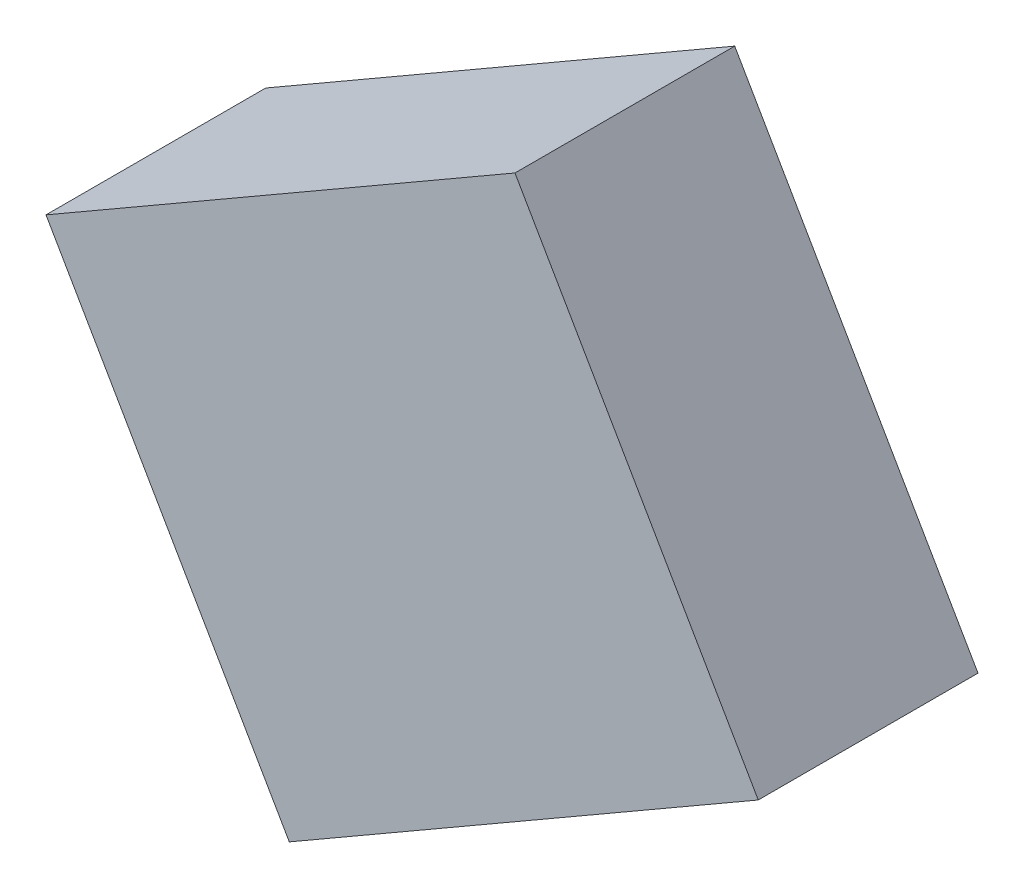
ISO-10303-21;
HEADER;
FILE_DESCRIPTION(('STEP AP214'),'2;1');
FILE_NAME('part.step','',(''),(''),'','','');
FILE_SCHEMA(('AUTOMOTIVE_DESIGN { 1 0 10303 214 1 1 1 1 }'));
ENDSEC;
DATA;
#1=APPLICATION_CONTEXT('core data for automotive mechanical design processes');
#2=APPLICATION_PROTOCOL_DEFINITION('international standard','automotive_design',2000,#1);
#3=PRODUCT_CONTEXT('',#1,'mechanical');
#4=PRODUCT('Part','Part','',(#3));
#5=PRODUCT_RELATED_PRODUCT_CATEGORY('part','',(#4));
#6=PRODUCT_DEFINITION_FORMATION('','',#4);
#7=PRODUCT_DEFINITION_CONTEXT('part definition',#1,'design');
#8=PRODUCT_DEFINITION('design','',#6,#7);
#9=PRODUCT_DEFINITION_SHAPE('','',#8);
#10=(LENGTH_UNIT() NAMED_UNIT(*) SI_UNIT(.MILLI.,.METRE.));
#11=(NAMED_UNIT(*) PLANE_ANGLE_UNIT() SI_UNIT($,.RADIAN.));
#12=(NAMED_UNIT(*) SI_UNIT($,.STERADIAN.) SOLID_ANGLE_UNIT());
#13=UNCERTAINTY_MEASURE_WITH_UNIT(LENGTH_MEASURE(1.E-05),#10,'distance_accuracy_value','');
#14=(GEOMETRIC_REPRESENTATION_CONTEXT(3) GLOBAL_UNCERTAINTY_ASSIGNED_CONTEXT((#13)) GLOBAL_UNIT_ASSIGNED_CONTEXT((#10,
#11,#12)) REPRESENTATION_CONTEXT('',''));
#15=CARTESIAN_POINT('',(0.,0.,0.));
#16=DIRECTION('',(0.,0.,1.));
#17=DIRECTION('',(1.,0.,0.));
#18=AXIS2_PLACEMENT_3D('',#15,#16,#17);
#19=CARTESIAN_POINT('',(-2.2688931,0.47984156,1.39999974));
#20=DIRECTION('',(0.,0.,-1.));
#21=DIRECTION('',(-1.,0.,0.));
#22=AXIS2_PLACEMENT_3D('',#19,#20,#21);
#23=PLANE('',#22);
#24=DIRECTION('',(-0.866024975812802,-0.500000741267886,0.));
#25=VECTOR('',#24,1.);
#26=CARTESIAN_POINT('',(-0.71889366,-2.20483938,1.39999974));
#27=LINE('',#26,#25);
#28=CARTESIAN_POINT('',(-0.718893659999777,-2.20483937999987,1.39999974));
#29=VERTEX_POINT('',#28);
#30=CARTESIAN_POINT('',(2.26889309999989,-0.479836479999813,1.39999974));
#31=VERTEX_POINT('',#30);
#32=EDGE_CURVE('E55',#29,#31,#27,.F.);
#33=ORIENTED_EDGE('',*,*,#32,.T.);
#34=DIRECTION('',(0.499999913646723,-0.866025453640521,0.));
#35=VECTOR('',#34,1.);
#36=CARTESIAN_POINT('',(2.2688931,-0.47983648,1.39999974));
#37=LINE('',#36,#35);
#38=CARTESIAN_POINT('',(0.718893659999855,2.20484191999992,1.39999974));
#39=VERTEX_POINT('',#38);
#40=EDGE_CURVE('E57',#31,#39,#37,.F.);
#41=ORIENTED_EDGE('',*,*,#40,.T.);
#42=DIRECTION('',(0.866025294610955,0.500000189093974,0.));
#43=VECTOR('',#42,1.);
#44=CARTESIAN_POINT('',(0.71889366,2.20484192,1.39999974));
#45=LINE('',#44,#43);
#46=CARTESIAN_POINT('',(-2.26889310000013,0.47984156000023,1.39999974));
#47=VERTEX_POINT('',#46);
#48=EDGE_CURVE('E20',#39,#47,#45,.F.);
#49=ORIENTED_EDGE('',*,*,#48,.T.);
#50=DIRECTION('',(-0.499999558855955,0.866025658478922,0.));
#51=VECTOR('',#50,1.);
#52=CARTESIAN_POINT('',(-2.2688931,0.47984156,1.39999974));
#53=LINE('',#52,#51);
#54=EDGE_CURVE('E80',#47,#29,#53,.F.);
#55=ORIENTED_EDGE('',*,*,#54,.T.);
#56=EDGE_LOOP('',(#33,#41,#49,#55));
#57=FACE_BOUND('',#56,.T.);
#58=ADVANCED_FACE('F17',(#57),#23,.F.);
#59=CARTESIAN_POINT('',(0.71889366,2.20484192,0.));
#60=DIRECTION('',(0.500000189093974,-0.866025294610955,0.));
#61=DIRECTION('',(0.866025294610955,0.500000189093974,0.));
#62=AXIS2_PLACEMENT_3D('',#59,#60,#61);
#63=PLANE('',#62);
#64=DIRECTION('',(0.,0.,1.));
#65=VECTOR('',#64,1.);
#66=CARTESIAN_POINT('',(-2.2688931,0.47984156,0.));
#67=LINE('',#66,#65);
#68=CARTESIAN_POINT('',(-2.26889310000013,0.47984156000023,0.));
#69=VERTEX_POINT('',#68);
#70=EDGE_CURVE('E68',#69,#47,#67,.T.);
#71=ORIENTED_EDGE('',*,*,#70,.T.);
#72=ORIENTED_EDGE('',*,*,#48,.F.);
#73=DIRECTION('',(0.,0.,1.));
#74=VECTOR('',#73,1.);
#75=CARTESIAN_POINT('',(0.718893659999419,2.20484191999967,0.));
#76=LINE('',#75,#74);
#77=CARTESIAN_POINT('',(0.718893659999855,2.20484191999992,0.));
#78=VERTEX_POINT('',#77);
#79=EDGE_CURVE('E63',#39,#78,#76,.F.);
#80=ORIENTED_EDGE('',*,*,#79,.T.);
#81=DIRECTION('',(0.866025294610877,0.500000189094107,0.));
#82=VECTOR('',#81,1.);
#83=CARTESIAN_POINT('',(-2.2688931,0.47984156,0.));
#84=LINE('',#83,#82);
#85=EDGE_CURVE('E83',#69,#78,#84,.T.);
#86=ORIENTED_EDGE('',*,*,#85,.F.);
#87=EDGE_LOOP('',(#71,#72,#80,#86));
#88=FACE_BOUND('',#87,.T.);
#89=ADVANCED_FACE('F65',(#88),#63,.F.);
#90=CARTESIAN_POINT('',(2.2688931,-0.47983648,0.));
#91=DIRECTION('',(-0.866025453640521,-0.499999913646723,0.));
#92=DIRECTION('',(0.499999913646723,-0.866025453640521,0.));
#93=AXIS2_PLACEMENT_3D('',#90,#91,#92);
#94=PLANE('',#93);
#95=ORIENTED_EDGE('',*,*,#79,.F.);
#96=ORIENTED_EDGE('',*,*,#40,.F.);
#97=DIRECTION('',(0.,0.,1.));
#98=VECTOR('',#97,1.);
#99=CARTESIAN_POINT('',(2.26889309999957,-0.479836479999254,0.));
#100=LINE('',#99,#98);
#101=CARTESIAN_POINT('',(2.26889309999989,-0.479836479999813,0.));
#102=VERTEX_POINT('',#101);
#103=EDGE_CURVE('E75',#31,#102,#100,.F.);
#104=ORIENTED_EDGE('',*,*,#103,.T.);
#105=DIRECTION('',(0.499999913646536,-0.866025453640629,0.));
#106=VECTOR('',#105,1.);
#107=CARTESIAN_POINT('',(0.71889366,2.20484192,0.));
#108=LINE('',#107,#106);
#109=EDGE_CURVE('E72',#78,#102,#108,.T.);
#110=ORIENTED_EDGE('',*,*,#109,.F.);
#111=EDGE_LOOP('',(#95,#96,#104,#110));
#112=FACE_BOUND('',#111,.T.);
#113=ADVANCED_FACE('F70',(#112),#94,.F.);
#114=CARTESIAN_POINT('',(-0.71889366,-2.20483938,0.));
#115=DIRECTION('',(-0.500000741267886,0.866024975812802,0.));
#116=DIRECTION('',(-0.866024975812802,-0.500000741267886,0.));
#117=AXIS2_PLACEMENT_3D('',#114,#115,#116);
#118=PLANE('',#117);
#119=ORIENTED_EDGE('',*,*,#103,.F.);
#120=ORIENTED_EDGE('',*,*,#32,.F.);
#121=DIRECTION('',(0.,0.,1.));
#122=VECTOR('',#121,1.);
#123=CARTESIAN_POINT('',(-0.718893659999108,-2.20483937999949,0.));
#124=LINE('',#123,#122);
#125=CARTESIAN_POINT('',(-0.718893659999777,-2.20483937999987,0.));
#126=VERTEX_POINT('',#125);
#127=EDGE_CURVE('E35',#29,#126,#124,.F.);
#128=ORIENTED_EDGE('',*,*,#127,.T.);
#129=DIRECTION('',(-0.866024975812927,-0.50000074126767,0.));
#130=VECTOR('',#129,1.);
#131=CARTESIAN_POINT('',(2.2688931,-0.47983648,0.));
#132=LINE('',#131,#130);
#133=EDGE_CURVE('E26',#102,#126,#132,.T.);
#134=ORIENTED_EDGE('',*,*,#133,.F.);
#135=EDGE_LOOP('',(#119,#120,#128,#134));
#136=FACE_BOUND('',#135,.T.);
#137=ADVANCED_FACE('F89',(#136),#118,.F.);
#138=CARTESIAN_POINT('',(-2.2688931,0.47984156,0.));
#139=DIRECTION('',(0.866025658478922,0.499999558855955,0.));
#140=DIRECTION('',(-0.499999558855955,0.866025658478922,0.));
#141=AXIS2_PLACEMENT_3D('',#138,#139,#140);
#142=PLANE('',#141);
#143=ORIENTED_EDGE('',*,*,#127,.F.);
#144=ORIENTED_EDGE('',*,*,#54,.F.);
#145=ORIENTED_EDGE('',*,*,#70,.F.);
#146=DIRECTION('',(-0.499999558855667,0.866025658479088,0.));
#147=VECTOR('',#146,1.);
#148=CARTESIAN_POINT('',(-0.71889366,-2.20483938,0.));
#149=LINE('',#148,#147);
#150=EDGE_CURVE('E11',#126,#69,#149,.T.);
#151=ORIENTED_EDGE('',*,*,#150,.F.);
#152=EDGE_LOOP('',(#143,#144,#145,#151));
#153=FACE_BOUND('',#152,.T.);
#154=ADVANCED_FACE('F91',(#153),#142,.F.);
#155=CARTESIAN_POINT('',(-2.2688931,0.47984156,0.));
#156=DIRECTION('',(0.,0.,-1.));
#157=DIRECTION('',(-1.,0.,0.));
#158=AXIS2_PLACEMENT_3D('',#155,#156,#157);
#159=PLANE('',#158);
#160=ORIENTED_EDGE('',*,*,#133,.T.);
#161=ORIENTED_EDGE('',*,*,#150,.T.);
#162=ORIENTED_EDGE('',*,*,#85,.T.);
#163=ORIENTED_EDGE('',*,*,#109,.T.);
#164=EDGE_LOOP('',(#160,#161,#162,#163));
#165=FACE_BOUND('',#164,.T.);
#166=ADVANCED_FACE('F88',(#165),#159,.T.);
#167=CLOSED_SHELL('',(#58,#89,#113,#137,#154,#166));
#168=MANIFOLD_SOLID_BREP('B1',#167);
#169=ADVANCED_BREP_SHAPE_REPRESENTATION('',(#18,#168),#14);
#170=SHAPE_DEFINITION_REPRESENTATION(#9,#169);
ENDSEC;
END-ISO-10303-21;
